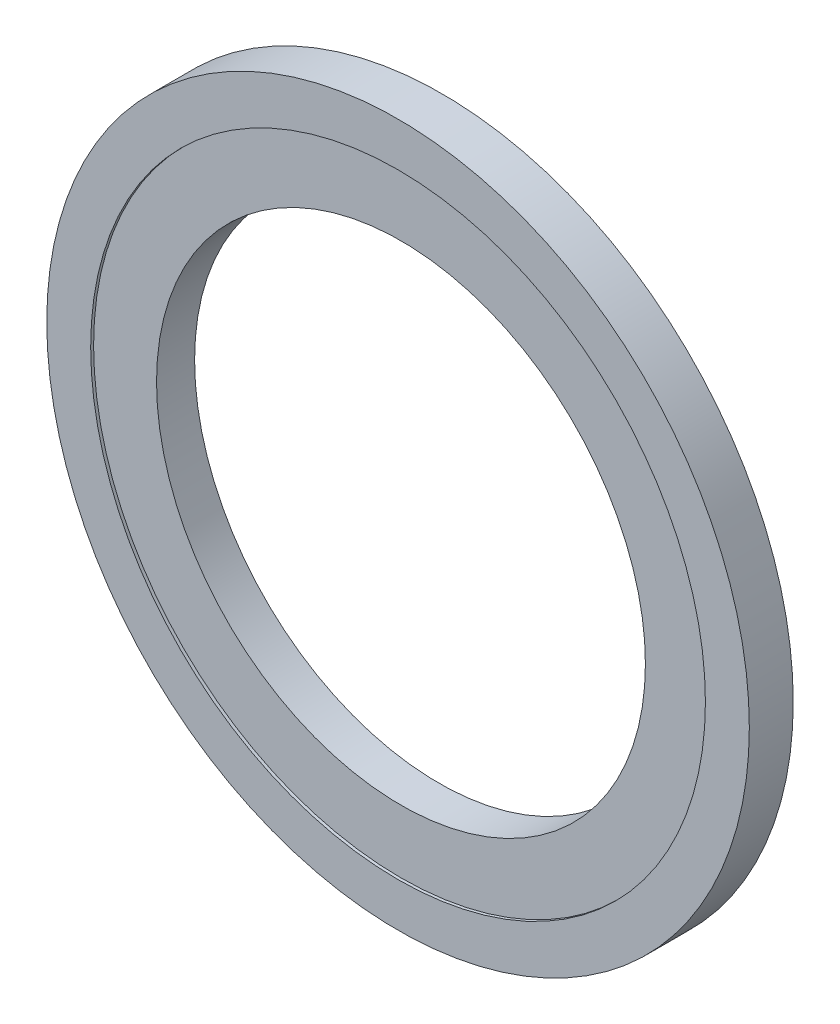
ISO-10303-21;
HEADER;
FILE_DESCRIPTION(('STEP AP214'),'2;1');
FILE_NAME('part.step','',(''),(''),'','','');
FILE_SCHEMA(('AUTOMOTIVE_DESIGN { 1 0 10303 214 1 1 1 1 }'));
ENDSEC;
DATA;
#1=APPLICATION_CONTEXT('core data for automotive mechanical design processes');
#2=APPLICATION_PROTOCOL_DEFINITION('international standard','automotive_design',2000,#1);
#3=PRODUCT_CONTEXT('',#1,'mechanical');
#4=PRODUCT('Part','Part','',(#3));
#5=PRODUCT_RELATED_PRODUCT_CATEGORY('part','',(#4));
#6=PRODUCT_DEFINITION_FORMATION('','',#4);
#7=PRODUCT_DEFINITION_CONTEXT('part definition',#1,'design');
#8=PRODUCT_DEFINITION('design','',#6,#7);
#9=PRODUCT_DEFINITION_SHAPE('','',#8);
#10=(LENGTH_UNIT() NAMED_UNIT(*) SI_UNIT(.MILLI.,.METRE.));
#11=(NAMED_UNIT(*) PLANE_ANGLE_UNIT() SI_UNIT($,.RADIAN.));
#12=(NAMED_UNIT(*) SI_UNIT($,.STERADIAN.) SOLID_ANGLE_UNIT());
#13=UNCERTAINTY_MEASURE_WITH_UNIT(LENGTH_MEASURE(1.E-05),#10,'distance_accuracy_value','');
#14=(GEOMETRIC_REPRESENTATION_CONTEXT(3) GLOBAL_UNCERTAINTY_ASSIGNED_CONTEXT((#13)) GLOBAL_UNIT_ASSIGNED_CONTEXT((#10,
#11,#12)) REPRESENTATION_CONTEXT('',''));
#15=CARTESIAN_POINT('',(0.,0.,0.));
#16=DIRECTION('',(0.,0.,1.));
#17=DIRECTION('',(1.,0.,0.));
#18=AXIS2_PLACEMENT_3D('',#15,#16,#17);
#19=CARTESIAN_POINT('',(0.,0.,1.5));
#20=DIRECTION('',(0.,0.,-1.));
#21=DIRECTION('',(-1.,0.,0.));
#22=AXIS2_PLACEMENT_3D('',#19,#20,#21);
#23=CYLINDRICAL_SURFACE('',#22,8.35);
#24=CARTESIAN_POINT('',(0.,0.,1.4));
#25=DIRECTION('',(0.,0.,1.));
#26=DIRECTION('',(1.,0.,0.));
#27=AXIS2_PLACEMENT_3D('',#24,#25,#26);
#28=CIRCLE('',#27,8.35);
#29=CARTESIAN_POINT('',(8.35,0.,1.4));
#30=VERTEX_POINT('',#29);
#31=EDGE_CURVE('E49',#30,#30,#28,.T.);
#32=ORIENTED_EDGE('',*,*,#31,.T.);
#33=EDGE_LOOP('',(#32));
#34=FACE_BOUND('',#33,.T.);
#35=CARTESIAN_POINT('',(0.,0.,0.1));
#36=DIRECTION('',(0.,0.,-1.));
#37=DIRECTION('',(-1.,0.,0.));
#38=AXIS2_PLACEMENT_3D('',#35,#36,#37);
#39=CIRCLE('',#38,8.35);
#40=CARTESIAN_POINT('',(-8.35,0.,0.1));
#41=VERTEX_POINT('',#40);
#42=EDGE_CURVE('E40',#41,#41,#39,.T.);
#43=ORIENTED_EDGE('',*,*,#42,.T.);
#44=EDGE_LOOP('',(#43));
#45=FACE_BOUND('',#44,.T.);
#46=ADVANCED_FACE('F36',(#34,#45),#23,.F.);
#47=CARTESIAN_POINT('',(0.,0.,1.5));
#48=DIRECTION('',(0.,0.,1.));
#49=DIRECTION('',(1.,0.,0.));
#50=AXIS2_PLACEMENT_3D('',#47,#48,#49);
#51=PLANE('',#50);
#52=CARTESIAN_POINT('',(0.,0.,1.5));
#53=DIRECTION('',(0.,0.,1.));
#54=DIRECTION('',(1.,0.,0.));
#55=AXIS2_PLACEMENT_3D('',#52,#53,#54);
#56=CIRCLE('',#55,10.5);
#57=CARTESIAN_POINT('',(10.5,0.,1.5));
#58=VERTEX_POINT('',#57);
#59=EDGE_CURVE('E52',#58,#58,#56,.T.);
#60=ORIENTED_EDGE('',*,*,#59,.F.);
#61=EDGE_LOOP('',(#60));
#62=FACE_BOUND('',#61,.T.);
#63=CARTESIAN_POINT('',(0.,0.,1.5));
#64=DIRECTION('',(0.,0.,1.));
#65=DIRECTION('',(1.,0.,0.));
#66=AXIS2_PLACEMENT_3D('',#63,#64,#65);
#67=CIRCLE('',#66,12.);
#68=CARTESIAN_POINT('',(12.,0.,1.5));
#69=VERTEX_POINT('',#68);
#70=EDGE_CURVE('E10',#69,#69,#67,.T.);
#71=ORIENTED_EDGE('',*,*,#70,.T.);
#72=EDGE_LOOP('',(#71));
#73=FACE_BOUND('',#72,.T.);
#74=ADVANCED_FACE('F85',(#62,#73),#51,.T.);
#75=CARTESIAN_POINT('',(0.,0.,0.));
#76=DIRECTION('',(0.,0.,1.));
#77=DIRECTION('',(1.,0.,0.));
#78=AXIS2_PLACEMENT_3D('',#75,#76,#77);
#79=PLANE('',#78);
#80=CARTESIAN_POINT('',(0.,0.,0.));
#81=DIRECTION('',(0.,0.,-1.));
#82=DIRECTION('',(-1.,0.,0.));
#83=AXIS2_PLACEMENT_3D('',#80,#81,#82);
#84=CIRCLE('',#83,10.5);
#85=CARTESIAN_POINT('',(-10.5,0.,0.));
#86=VERTEX_POINT('',#85);
#87=EDGE_CURVE('E63',#86,#86,#84,.T.);
#88=ORIENTED_EDGE('',*,*,#87,.F.);
#89=EDGE_LOOP('',(#88));
#90=FACE_BOUND('',#89,.T.);
#91=CARTESIAN_POINT('',(0.,0.,0.));
#92=DIRECTION('',(0.,0.,1.));
#93=DIRECTION('',(1.,0.,0.));
#94=AXIS2_PLACEMENT_3D('',#91,#92,#93);
#95=CIRCLE('',#94,12.);
#96=CARTESIAN_POINT('',(12.,0.,0.));
#97=VERTEX_POINT('',#96);
#98=EDGE_CURVE('E44',#97,#97,#95,.T.);
#99=ORIENTED_EDGE('',*,*,#98,.F.);
#100=EDGE_LOOP('',(#99));
#101=FACE_BOUND('',#100,.T.);
#102=ADVANCED_FACE('F90',(#90,#101),#79,.F.);
#103=CARTESIAN_POINT('',(0.,0.,1.5));
#104=DIRECTION('',(0.,0.,-1.));
#105=DIRECTION('',(-1.,0.,0.));
#106=AXIS2_PLACEMENT_3D('',#103,#104,#105);
#107=CYLINDRICAL_SURFACE('',#106,12.);
#108=ORIENTED_EDGE('',*,*,#70,.F.);
#109=EDGE_LOOP('',(#108));
#110=FACE_BOUND('',#109,.T.);
#111=ORIENTED_EDGE('',*,*,#98,.T.);
#112=EDGE_LOOP('',(#111));
#113=FACE_BOUND('',#112,.T.);
#114=ADVANCED_FACE('F38',(#110,#113),#107,.T.);
#115=CARTESIAN_POINT('',(0.,0.,1.4));
#116=DIRECTION('',(0.,0.,1.));
#117=DIRECTION('',(1.,0.,0.));
#118=AXIS2_PLACEMENT_3D('',#115,#116,#117);
#119=CYLINDRICAL_SURFACE('',#118,10.5);
#120=CARTESIAN_POINT('',(0.,0.,1.4));
#121=DIRECTION('',(0.,0.,1.));
#122=DIRECTION('',(1.,0.,0.));
#123=AXIS2_PLACEMENT_3D('',#120,#121,#122);
#124=CIRCLE('',#123,10.5);
#125=CARTESIAN_POINT('',(10.5,0.,1.4));
#126=VERTEX_POINT('',#125);
#127=EDGE_CURVE('E55',#126,#126,#124,.T.);
#128=ORIENTED_EDGE('',*,*,#127,.F.);
#129=EDGE_LOOP('',(#128));
#130=FACE_BOUND('',#129,.T.);
#131=ORIENTED_EDGE('',*,*,#59,.T.);
#132=EDGE_LOOP('',(#131));
#133=FACE_BOUND('',#132,.T.);
#134=ADVANCED_FACE('F94',(#130,#133),#119,.F.);
#135=CARTESIAN_POINT('',(0.,0.,1.4));
#136=DIRECTION('',(0.,0.,1.));
#137=DIRECTION('',(1.,0.,0.));
#138=AXIS2_PLACEMENT_3D('',#135,#136,#137);
#139=PLANE('',#138);
#140=ORIENTED_EDGE('',*,*,#31,.F.);
#141=EDGE_LOOP('',(#140));
#142=FACE_BOUND('',#141,.T.);
#143=ORIENTED_EDGE('',*,*,#127,.T.);
#144=EDGE_LOOP('',(#143));
#145=FACE_BOUND('',#144,.T.);
#146=ADVANCED_FACE('F81',(#142,#145),#139,.T.);
#147=CARTESIAN_POINT('',(0.,0.,0.1));
#148=DIRECTION('',(0.,0.,-1.));
#149=DIRECTION('',(-1.,0.,0.));
#150=AXIS2_PLACEMENT_3D('',#147,#148,#149);
#151=CYLINDRICAL_SURFACE('',#150,10.5);
#152=CARTESIAN_POINT('',(0.,0.,0.1));
#153=DIRECTION('',(0.,0.,-1.));
#154=DIRECTION('',(-1.,0.,0.));
#155=AXIS2_PLACEMENT_3D('',#152,#153,#154);
#156=CIRCLE('',#155,10.5);
#157=CARTESIAN_POINT('',(-10.5,0.,0.1));
#158=VERTEX_POINT('',#157);
#159=EDGE_CURVE('E66',#158,#158,#156,.T.);
#160=ORIENTED_EDGE('',*,*,#159,.F.);
#161=EDGE_LOOP('',(#160));
#162=FACE_BOUND('',#161,.T.);
#163=ORIENTED_EDGE('',*,*,#87,.T.);
#164=EDGE_LOOP('',(#163));
#165=FACE_BOUND('',#164,.T.);
#166=ADVANCED_FACE('F76',(#162,#165),#151,.F.);
#167=CARTESIAN_POINT('',(0.,0.,0.1));
#168=DIRECTION('',(0.,0.,-1.));
#169=DIRECTION('',(-1.,0.,0.));
#170=AXIS2_PLACEMENT_3D('',#167,#168,#169);
#171=PLANE('',#170);
#172=ORIENTED_EDGE('',*,*,#42,.F.);
#173=EDGE_LOOP('',(#172));
#174=FACE_BOUND('',#173,.T.);
#175=ORIENTED_EDGE('',*,*,#159,.T.);
#176=EDGE_LOOP('',(#175));
#177=FACE_BOUND('',#176,.T.);
#178=ADVANCED_FACE('F74',(#174,#177),#171,.T.);
#179=CLOSED_SHELL('',(#46,#74,#102,#114,#134,#146,#166,#178));
#180=MANIFOLD_SOLID_BREP('B2',#179);
#181=ADVANCED_BREP_SHAPE_REPRESENTATION('',(#18,#180),#14);
#182=SHAPE_DEFINITION_REPRESENTATION(#9,#181);
ENDSEC;
END-ISO-10303-21;
